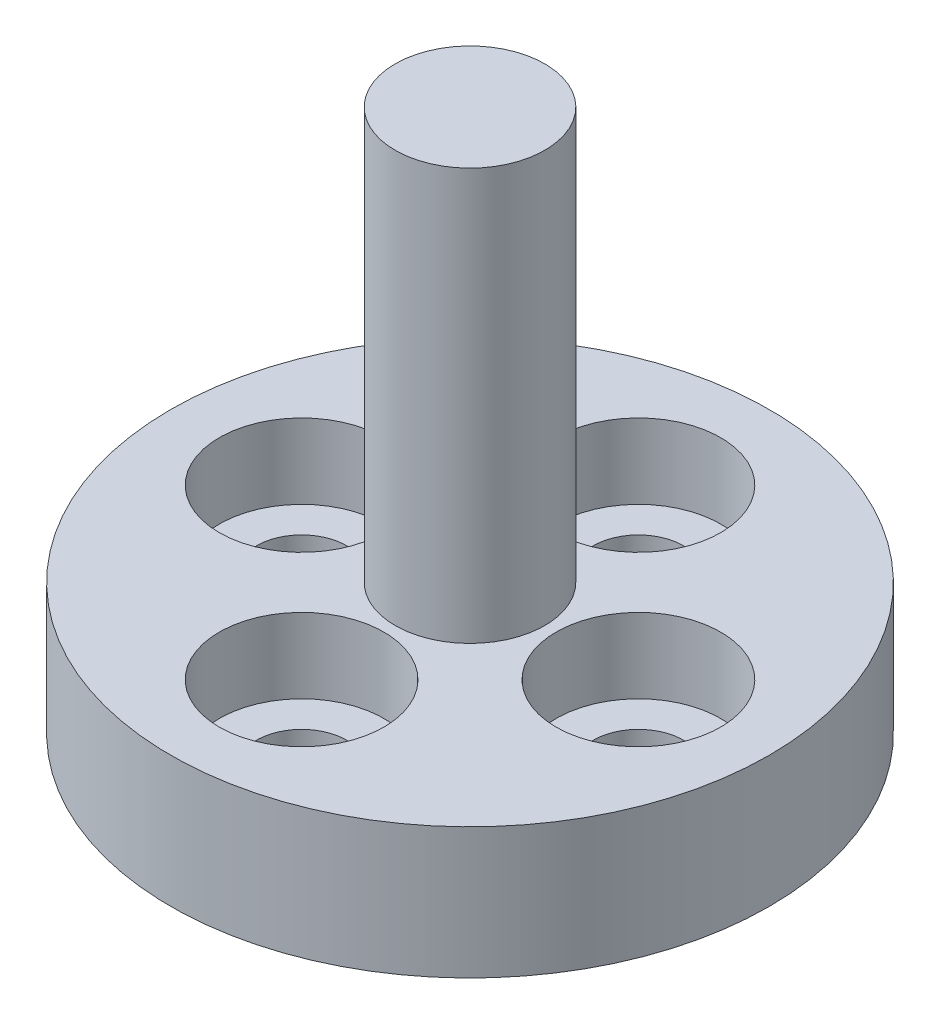
ISO-10303-21;
HEADER;
FILE_DESCRIPTION(('STEP AP214'),'2;1');
FILE_NAME('part.step','',(''),(''),'','','');
FILE_SCHEMA(('AUTOMOTIVE_DESIGN { 1 0 10303 214 1 1 1 1 }'));
ENDSEC;
DATA;
#1=APPLICATION_CONTEXT('core data for automotive mechanical design processes');
#2=APPLICATION_PROTOCOL_DEFINITION('international standard','automotive_design',2000,#1);
#3=PRODUCT_CONTEXT('',#1,'mechanical');
#4=PRODUCT('Part','Part','',(#3));
#5=PRODUCT_RELATED_PRODUCT_CATEGORY('part','',(#4));
#6=PRODUCT_DEFINITION_FORMATION('','',#4);
#7=PRODUCT_DEFINITION_CONTEXT('part definition',#1,'design');
#8=PRODUCT_DEFINITION('design','',#6,#7);
#9=PRODUCT_DEFINITION_SHAPE('','',#8);
#10=(LENGTH_UNIT() NAMED_UNIT(*) SI_UNIT(.MILLI.,.METRE.));
#11=(NAMED_UNIT(*) PLANE_ANGLE_UNIT() SI_UNIT($,.RADIAN.));
#12=(NAMED_UNIT(*) SI_UNIT($,.STERADIAN.) SOLID_ANGLE_UNIT());
#13=UNCERTAINTY_MEASURE_WITH_UNIT(LENGTH_MEASURE(1.E-05),#10,'distance_accuracy_value','');
#14=(GEOMETRIC_REPRESENTATION_CONTEXT(3) GLOBAL_UNCERTAINTY_ASSIGNED_CONTEXT((#13)) GLOBAL_UNIT_ASSIGNED_CONTEXT((#10,
#11,#12)) REPRESENTATION_CONTEXT('',''));
#15=CARTESIAN_POINT('',(0.,0.,0.));
#16=DIRECTION('',(0.,0.,1.));
#17=DIRECTION('',(1.,0.,0.));
#18=AXIS2_PLACEMENT_3D('',#15,#16,#17);
#19=CARTESIAN_POINT('',(0.,0.,0.));
#20=DIRECTION('',(0.,1.,0.));
#21=DIRECTION('',(-1.,0.,0.));
#22=AXIS2_PLACEMENT_3D('',#19,#20,#21);
#23=PLANE('',#22);
#24=CARTESIAN_POINT('',(-4.5,0.,0.));
#25=DIRECTION('',(0.,1.,0.));
#26=DIRECTION('',(0.,0.,1.));
#27=AXIS2_PLACEMENT_3D('',#24,#25,#26);
#28=CIRCLE('',#27,1.2);
#29=CARTESIAN_POINT('',(-4.5,0.,1.2));
#30=VERTEX_POINT('',#29);
#31=EDGE_CURVE('E89',#30,#30,#28,.T.);
#32=ORIENTED_EDGE('',*,*,#31,.T.);
#33=EDGE_LOOP('',(#32));
#34=FACE_BOUND('',#33,.T.);
#35=CARTESIAN_POINT('',(0.,0.,-4.5));
#36=DIRECTION('',(0.,1.,0.));
#37=DIRECTION('',(0.,0.,1.));
#38=AXIS2_PLACEMENT_3D('',#35,#36,#37);
#39=CIRCLE('',#38,1.2);
#40=CARTESIAN_POINT('',(0.,0.,-3.3));
#41=VERTEX_POINT('',#40);
#42=EDGE_CURVE('E77',#41,#41,#39,.T.);
#43=ORIENTED_EDGE('',*,*,#42,.T.);
#44=EDGE_LOOP('',(#43));
#45=FACE_BOUND('',#44,.T.);
#46=CARTESIAN_POINT('',(4.5,0.,0.));
#47=DIRECTION('',(0.,1.,0.));
#48=DIRECTION('',(0.,0.,1.));
#49=AXIS2_PLACEMENT_3D('',#46,#47,#48);
#50=CIRCLE('',#49,1.2);
#51=CARTESIAN_POINT('',(4.5,0.,1.2));
#52=VERTEX_POINT('',#51);
#53=EDGE_CURVE('E65',#52,#52,#50,.T.);
#54=ORIENTED_EDGE('',*,*,#53,.T.);
#55=EDGE_LOOP('',(#54));
#56=FACE_BOUND('',#55,.T.);
#57=CARTESIAN_POINT('',(0.,0.,4.5));
#58=DIRECTION('',(0.,1.,0.));
#59=DIRECTION('',(0.,0.,1.));
#60=AXIS2_PLACEMENT_3D('',#57,#58,#59);
#61=CIRCLE('',#60,1.2);
#62=CARTESIAN_POINT('',(0.,0.,5.7));
#63=VERTEX_POINT('',#62);
#64=EDGE_CURVE('E53',#63,#63,#61,.T.);
#65=ORIENTED_EDGE('',*,*,#64,.T.);
#66=EDGE_LOOP('',(#65));
#67=FACE_BOUND('',#66,.T.);
#68=CARTESIAN_POINT('',(0.,0.,0.));
#69=DIRECTION('',(0.,1.,0.));
#70=DIRECTION('',(-1.,0.,0.));
#71=AXIS2_PLACEMENT_3D('',#68,#69,#70);
#72=CIRCLE('',#71,8.);
#73=CARTESIAN_POINT('',(-8.,0.,0.));
#74=VERTEX_POINT('',#73);
#75=EDGE_CURVE('E10',#74,#74,#72,.T.);
#76=ORIENTED_EDGE('',*,*,#75,.F.);
#77=EDGE_LOOP('',(#76));
#78=FACE_BOUND('',#77,.T.);
#79=ADVANCED_FACE('F34',(#34,#45,#56,#67,#78),#23,.F.);
#80=CARTESIAN_POINT('',(0.,14.5,0.));
#81=DIRECTION('',(0.,1.,0.));
#82=DIRECTION('',(-1.,0.,0.));
#83=AXIS2_PLACEMENT_3D('',#80,#81,#82);
#84=CYLINDRICAL_SURFACE('',#83,8.);
#85=CARTESIAN_POINT('',(0.,3.5,0.));
#86=DIRECTION('',(0.,1.,0.));
#87=DIRECTION('',(-1.,0.,0.));
#88=AXIS2_PLACEMENT_3D('',#85,#86,#87);
#89=CIRCLE('',#88,8.);
#90=CARTESIAN_POINT('',(-8.,3.5,0.));
#91=VERTEX_POINT('',#90);
#92=EDGE_CURVE('E40',#91,#91,#89,.T.);
#93=ORIENTED_EDGE('',*,*,#92,.F.);
#94=EDGE_LOOP('',(#93));
#95=FACE_BOUND('',#94,.T.);
#96=ORIENTED_EDGE('',*,*,#75,.T.);
#97=EDGE_LOOP('',(#96));
#98=FACE_BOUND('',#97,.T.);
#99=ADVANCED_FACE('F108',(#95,#98),#84,.T.);
#100=CARTESIAN_POINT('',(8.,3.5,0.));
#101=DIRECTION('',(0.,-1.,0.));
#102=DIRECTION('',(1.,0.,0.));
#103=AXIS2_PLACEMENT_3D('',#100,#101,#102);
#104=PLANE('',#103);
#105=CARTESIAN_POINT('',(-4.5,3.5,0.));
#106=DIRECTION('',(0.,1.,0.));
#107=DIRECTION('',(0.,0.,1.));
#108=AXIS2_PLACEMENT_3D('',#105,#106,#107);
#109=CIRCLE('',#108,2.2);
#110=CARTESIAN_POINT('',(-4.5,3.5,2.2));
#111=VERTEX_POINT('',#110);
#112=EDGE_CURVE('E98',#111,#111,#109,.T.);
#113=ORIENTED_EDGE('',*,*,#112,.F.);
#114=EDGE_LOOP('',(#113));
#115=FACE_BOUND('',#114,.T.);
#116=CARTESIAN_POINT('',(0.,3.5,-4.5));
#117=DIRECTION('',(0.,1.,0.));
#118=DIRECTION('',(0.,0.,1.));
#119=AXIS2_PLACEMENT_3D('',#116,#117,#118);
#120=CIRCLE('',#119,2.2);
#121=CARTESIAN_POINT('',(0.,3.5,-2.3));
#122=VERTEX_POINT('',#121);
#123=EDGE_CURVE('E86',#122,#122,#120,.T.);
#124=ORIENTED_EDGE('',*,*,#123,.F.);
#125=EDGE_LOOP('',(#124));
#126=FACE_BOUND('',#125,.T.);
#127=CARTESIAN_POINT('',(4.5,3.5,0.));
#128=DIRECTION('',(0.,1.,0.));
#129=DIRECTION('',(0.,0.,1.));
#130=AXIS2_PLACEMENT_3D('',#127,#128,#129);
#131=CIRCLE('',#130,2.2);
#132=CARTESIAN_POINT('',(4.5,3.5,2.2));
#133=VERTEX_POINT('',#132);
#134=EDGE_CURVE('E74',#133,#133,#131,.T.);
#135=ORIENTED_EDGE('',*,*,#134,.F.);
#136=EDGE_LOOP('',(#135));
#137=FACE_BOUND('',#136,.T.);
#138=CARTESIAN_POINT('',(0.,3.5,4.5));
#139=DIRECTION('',(0.,1.,0.));
#140=DIRECTION('',(0.,0.,1.));
#141=AXIS2_PLACEMENT_3D('',#138,#139,#140);
#142=CIRCLE('',#141,2.2);
#143=CARTESIAN_POINT('',(0.,3.5,6.7));
#144=VERTEX_POINT('',#143);
#145=EDGE_CURVE('E62',#144,#144,#142,.T.);
#146=ORIENTED_EDGE('',*,*,#145,.F.);
#147=EDGE_LOOP('',(#146));
#148=FACE_BOUND('',#147,.T.);
#149=CARTESIAN_POINT('',(0.,3.5,0.));
#150=DIRECTION('',(0.,1.,0.));
#151=DIRECTION('',(-1.,0.,0.));
#152=AXIS2_PLACEMENT_3D('',#149,#150,#151);
#153=CIRCLE('',#152,2.);
#154=CARTESIAN_POINT('',(-2.,3.5,0.));
#155=VERTEX_POINT('',#154);
#156=EDGE_CURVE('E44',#155,#155,#153,.T.);
#157=ORIENTED_EDGE('',*,*,#156,.F.);
#158=EDGE_LOOP('',(#157));
#159=FACE_BOUND('',#158,.T.);
#160=ORIENTED_EDGE('',*,*,#92,.T.);
#161=EDGE_LOOP('',(#160));
#162=FACE_BOUND('',#161,.T.);
#163=ADVANCED_FACE('F104',(#115,#126,#137,#148,#159,#162),#104,.F.);
#164=CARTESIAN_POINT('',(0.,14.5,0.));
#165=DIRECTION('',(0.,1.,0.));
#166=DIRECTION('',(-1.,0.,0.));
#167=AXIS2_PLACEMENT_3D('',#164,#165,#166);
#168=CYLINDRICAL_SURFACE('',#167,2.);
#169=CARTESIAN_POINT('',(0.,14.5,0.));
#170=DIRECTION('',(0.,1.,0.));
#171=DIRECTION('',(-1.,0.,0.));
#172=AXIS2_PLACEMENT_3D('',#169,#170,#171);
#173=CIRCLE('',#172,2.);
#174=CARTESIAN_POINT('',(-2.,14.5,0.));
#175=VERTEX_POINT('',#174);
#176=EDGE_CURVE('E48',#175,#175,#173,.T.);
#177=ORIENTED_EDGE('',*,*,#176,.F.);
#178=EDGE_LOOP('',(#177));
#179=FACE_BOUND('',#178,.T.);
#180=ORIENTED_EDGE('',*,*,#156,.T.);
#181=EDGE_LOOP('',(#180));
#182=FACE_BOUND('',#181,.T.);
#183=ADVANCED_FACE('F107',(#179,#182),#168,.T.);
#184=CARTESIAN_POINT('',(2.,14.5,0.));
#185=DIRECTION('',(0.,-1.,0.));
#186=DIRECTION('',(1.,0.,0.));
#187=AXIS2_PLACEMENT_3D('',#184,#185,#186);
#188=PLANE('',#187);
#189=ORIENTED_EDGE('',*,*,#176,.T.);
#190=EDGE_LOOP('',(#189));
#191=FACE_BOUND('',#190,.T.);
#192=ADVANCED_FACE('F119',(#191),#188,.F.);
#193=CARTESIAN_POINT('',(0.,3.5,4.5));
#194=DIRECTION('',(0.,1.,0.));
#195=DIRECTION('',(0.,0.,1.));
#196=AXIS2_PLACEMENT_3D('',#193,#194,#195);
#197=CYLINDRICAL_SURFACE('',#196,1.2);
#198=ORIENTED_EDGE('',*,*,#64,.F.);
#199=EDGE_LOOP('',(#198));
#200=FACE_BOUND('',#199,.T.);
#201=CARTESIAN_POINT('',(0.,1.5,4.5));
#202=DIRECTION('',(0.,1.,0.));
#203=DIRECTION('',(0.,0.,1.));
#204=AXIS2_PLACEMENT_3D('',#201,#202,#203);
#205=CIRCLE('',#204,1.2);
#206=CARTESIAN_POINT('',(0.,1.5,5.7));
#207=VERTEX_POINT('',#206);
#208=EDGE_CURVE('E56',#207,#207,#205,.T.);
#209=ORIENTED_EDGE('',*,*,#208,.T.);
#210=EDGE_LOOP('',(#209));
#211=FACE_BOUND('',#210,.T.);
#212=ADVANCED_FACE('F125',(#200,#211),#197,.F.);
#213=CARTESIAN_POINT('',(1.2,1.5,4.5));
#214=DIRECTION('',(0.,-1.,0.));
#215=DIRECTION('',(0.,0.,-1.));
#216=AXIS2_PLACEMENT_3D('',#213,#214,#215);
#217=PLANE('',#216);
#218=ORIENTED_EDGE('',*,*,#208,.F.);
#219=EDGE_LOOP('',(#218));
#220=FACE_BOUND('',#219,.T.);
#221=CARTESIAN_POINT('',(0.,1.5,4.5));
#222=DIRECTION('',(0.,1.,0.));
#223=DIRECTION('',(0.,0.,1.));
#224=AXIS2_PLACEMENT_3D('',#221,#222,#223);
#225=CIRCLE('',#224,2.2);
#226=CARTESIAN_POINT('',(0.,1.5,6.7));
#227=VERTEX_POINT('',#226);
#228=EDGE_CURVE('E59',#227,#227,#225,.T.);
#229=ORIENTED_EDGE('',*,*,#228,.T.);
#230=EDGE_LOOP('',(#229));
#231=FACE_BOUND('',#230,.T.);
#232=ADVANCED_FACE('F146',(#220,#231),#217,.F.);
#233=CARTESIAN_POINT('',(0.,3.5,4.5));
#234=DIRECTION('',(0.,1.,0.));
#235=DIRECTION('',(0.,0.,1.));
#236=AXIS2_PLACEMENT_3D('',#233,#234,#235);
#237=CYLINDRICAL_SURFACE('',#236,2.2);
#238=ORIENTED_EDGE('',*,*,#228,.F.);
#239=EDGE_LOOP('',(#238));
#240=FACE_BOUND('',#239,.T.);
#241=ORIENTED_EDGE('',*,*,#145,.T.);
#242=EDGE_LOOP('',(#241));
#243=FACE_BOUND('',#242,.T.);
#244=ADVANCED_FACE('F152',(#240,#243),#237,.F.);
#245=CARTESIAN_POINT('',(4.5,3.5,0.));
#246=DIRECTION('',(0.,1.,0.));
#247=DIRECTION('',(0.,0.,1.));
#248=AXIS2_PLACEMENT_3D('',#245,#246,#247);
#249=CYLINDRICAL_SURFACE('',#248,1.2);
#250=ORIENTED_EDGE('',*,*,#53,.F.);
#251=EDGE_LOOP('',(#250));
#252=FACE_BOUND('',#251,.T.);
#253=CARTESIAN_POINT('',(4.5,1.5,0.));
#254=DIRECTION('',(0.,1.,0.));
#255=DIRECTION('',(0.,0.,1.));
#256=AXIS2_PLACEMENT_3D('',#253,#254,#255);
#257=CIRCLE('',#256,1.2);
#258=CARTESIAN_POINT('',(4.5,1.5,1.2));
#259=VERTEX_POINT('',#258);
#260=EDGE_CURVE('E68',#259,#259,#257,.T.);
#261=ORIENTED_EDGE('',*,*,#260,.T.);
#262=EDGE_LOOP('',(#261));
#263=FACE_BOUND('',#262,.T.);
#264=ADVANCED_FACE('F158',(#252,#263),#249,.F.);
#265=CARTESIAN_POINT('',(5.7,1.5,0.));
#266=DIRECTION('',(0.,-1.,0.));
#267=DIRECTION('',(0.,0.,-1.));
#268=AXIS2_PLACEMENT_3D('',#265,#266,#267);
#269=PLANE('',#268);
#270=ORIENTED_EDGE('',*,*,#260,.F.);
#271=EDGE_LOOP('',(#270));
#272=FACE_BOUND('',#271,.T.);
#273=CARTESIAN_POINT('',(4.5,1.5,0.));
#274=DIRECTION('',(0.,1.,0.));
#275=DIRECTION('',(0.,0.,1.));
#276=AXIS2_PLACEMENT_3D('',#273,#274,#275);
#277=CIRCLE('',#276,2.2);
#278=CARTESIAN_POINT('',(4.5,1.5,2.2));
#279=VERTEX_POINT('',#278);
#280=EDGE_CURVE('E71',#279,#279,#277,.T.);
#281=ORIENTED_EDGE('',*,*,#280,.T.);
#282=EDGE_LOOP('',(#281));
#283=FACE_BOUND('',#282,.T.);
#284=ADVANCED_FACE('F163',(#272,#283),#269,.F.);
#285=CARTESIAN_POINT('',(4.5,3.5,0.));
#286=DIRECTION('',(0.,1.,0.));
#287=DIRECTION('',(0.,0.,1.));
#288=AXIS2_PLACEMENT_3D('',#285,#286,#287);
#289=CYLINDRICAL_SURFACE('',#288,2.2);
#290=ORIENTED_EDGE('',*,*,#280,.F.);
#291=EDGE_LOOP('',(#290));
#292=FACE_BOUND('',#291,.T.);
#293=ORIENTED_EDGE('',*,*,#134,.T.);
#294=EDGE_LOOP('',(#293));
#295=FACE_BOUND('',#294,.T.);
#296=ADVANCED_FACE('F169',(#292,#295),#289,.F.);
#297=CARTESIAN_POINT('',(0.,3.5,-4.5));
#298=DIRECTION('',(0.,1.,0.));
#299=DIRECTION('',(0.,0.,1.));
#300=AXIS2_PLACEMENT_3D('',#297,#298,#299);
#301=CYLINDRICAL_SURFACE('',#300,1.2);
#302=ORIENTED_EDGE('',*,*,#42,.F.);
#303=EDGE_LOOP('',(#302));
#304=FACE_BOUND('',#303,.T.);
#305=CARTESIAN_POINT('',(0.,1.5,-4.5));
#306=DIRECTION('',(0.,1.,0.));
#307=DIRECTION('',(0.,0.,1.));
#308=AXIS2_PLACEMENT_3D('',#305,#306,#307);
#309=CIRCLE('',#308,1.2);
#310=CARTESIAN_POINT('',(0.,1.5,-3.3));
#311=VERTEX_POINT('',#310);
#312=EDGE_CURVE('E80',#311,#311,#309,.T.);
#313=ORIENTED_EDGE('',*,*,#312,.T.);
#314=EDGE_LOOP('',(#313));
#315=FACE_BOUND('',#314,.T.);
#316=ADVANCED_FACE('F173',(#304,#315),#301,.F.);
#317=CARTESIAN_POINT('',(1.2,1.5,-4.5));
#318=DIRECTION('',(0.,-1.,0.));
#319=DIRECTION('',(0.,0.,-1.));
#320=AXIS2_PLACEMENT_3D('',#317,#318,#319);
#321=PLANE('',#320);
#322=ORIENTED_EDGE('',*,*,#312,.F.);
#323=EDGE_LOOP('',(#322));
#324=FACE_BOUND('',#323,.T.);
#325=CARTESIAN_POINT('',(0.,1.5,-4.5));
#326=DIRECTION('',(0.,1.,0.));
#327=DIRECTION('',(0.,0.,1.));
#328=AXIS2_PLACEMENT_3D('',#325,#326,#327);
#329=CIRCLE('',#328,2.2);
#330=CARTESIAN_POINT('',(0.,1.5,-2.3));
#331=VERTEX_POINT('',#330);
#332=EDGE_CURVE('E83',#331,#331,#329,.T.);
#333=ORIENTED_EDGE('',*,*,#332,.T.);
#334=EDGE_LOOP('',(#333));
#335=FACE_BOUND('',#334,.T.);
#336=ADVANCED_FACE('F177',(#324,#335),#321,.F.);
#337=CARTESIAN_POINT('',(0.,3.5,-4.5));
#338=DIRECTION('',(0.,1.,0.));
#339=DIRECTION('',(0.,0.,1.));
#340=AXIS2_PLACEMENT_3D('',#337,#338,#339);
#341=CYLINDRICAL_SURFACE('',#340,2.2);
#342=ORIENTED_EDGE('',*,*,#332,.F.);
#343=EDGE_LOOP('',(#342));
#344=FACE_BOUND('',#343,.T.);
#345=ORIENTED_EDGE('',*,*,#123,.T.);
#346=EDGE_LOOP('',(#345));
#347=FACE_BOUND('',#346,.T.);
#348=ADVANCED_FACE('F181',(#344,#347),#341,.F.);
#349=CARTESIAN_POINT('',(-4.5,3.5,0.));
#350=DIRECTION('',(0.,1.,0.));
#351=DIRECTION('',(0.,0.,1.));
#352=AXIS2_PLACEMENT_3D('',#349,#350,#351);
#353=CYLINDRICAL_SURFACE('',#352,1.2);
#354=ORIENTED_EDGE('',*,*,#31,.F.);
#355=EDGE_LOOP('',(#354));
#356=FACE_BOUND('',#355,.T.);
#357=CARTESIAN_POINT('',(-4.5,1.5,0.));
#358=DIRECTION('',(0.,1.,0.));
#359=DIRECTION('',(0.,0.,1.));
#360=AXIS2_PLACEMENT_3D('',#357,#358,#359);
#361=CIRCLE('',#360,1.2);
#362=CARTESIAN_POINT('',(-4.5,1.5,1.2));
#363=VERTEX_POINT('',#362);
#364=EDGE_CURVE('E92',#363,#363,#361,.T.);
#365=ORIENTED_EDGE('',*,*,#364,.T.);
#366=EDGE_LOOP('',(#365));
#367=FACE_BOUND('',#366,.T.);
#368=ADVANCED_FACE('F185',(#356,#367),#353,.F.);
#369=CARTESIAN_POINT('',(-3.3,1.5,0.));
#370=DIRECTION('',(0.,-1.,0.));
#371=DIRECTION('',(0.,0.,-1.));
#372=AXIS2_PLACEMENT_3D('',#369,#370,#371);
#373=PLANE('',#372);
#374=ORIENTED_EDGE('',*,*,#364,.F.);
#375=EDGE_LOOP('',(#374));
#376=FACE_BOUND('',#375,.T.);
#377=CARTESIAN_POINT('',(-4.5,1.5,0.));
#378=DIRECTION('',(0.,1.,0.));
#379=DIRECTION('',(0.,0.,1.));
#380=AXIS2_PLACEMENT_3D('',#377,#378,#379);
#381=CIRCLE('',#380,2.2);
#382=CARTESIAN_POINT('',(-4.5,1.5,2.2));
#383=VERTEX_POINT('',#382);
#384=EDGE_CURVE('E95',#383,#383,#381,.T.);
#385=ORIENTED_EDGE('',*,*,#384,.T.);
#386=EDGE_LOOP('',(#385));
#387=FACE_BOUND('',#386,.T.);
#388=ADVANCED_FACE('F189',(#376,#387),#373,.F.);
#389=CARTESIAN_POINT('',(-4.5,3.5,0.));
#390=DIRECTION('',(0.,1.,0.));
#391=DIRECTION('',(0.,0.,1.));
#392=AXIS2_PLACEMENT_3D('',#389,#390,#391);
#393=CYLINDRICAL_SURFACE('',#392,2.2);
#394=ORIENTED_EDGE('',*,*,#384,.F.);
#395=EDGE_LOOP('',(#394));
#396=FACE_BOUND('',#395,.T.);
#397=ORIENTED_EDGE('',*,*,#112,.T.);
#398=EDGE_LOOP('',(#397));
#399=FACE_BOUND('',#398,.T.);
#400=ADVANCED_FACE('F102',(#396,#399),#393,.F.);
#401=CLOSED_SHELL('',(#79,#99,#163,#183,#192,#212,#232,#244,#264,#284,#296,#316,#336,#348,#368,
#388,#400));
#402=MANIFOLD_SOLID_BREP('B2',#401);
#403=ADVANCED_BREP_SHAPE_REPRESENTATION('',(#18,#402),#14);
#404=SHAPE_DEFINITION_REPRESENTATION(#9,#403);
ENDSEC;
END-ISO-10303-21;
